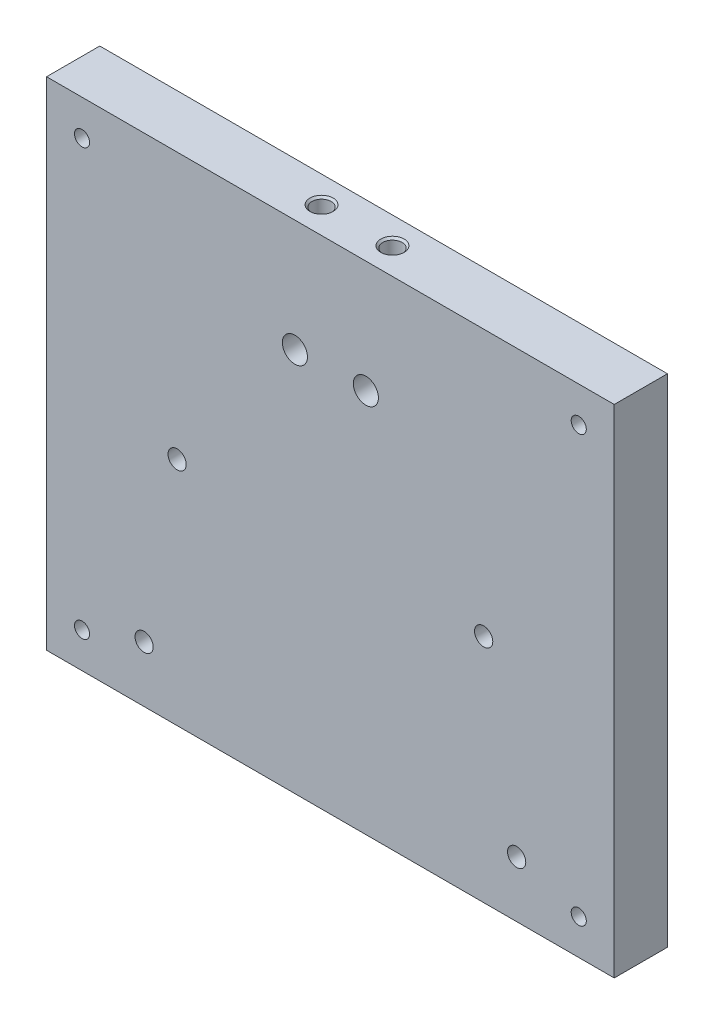
ISO-10303-21;
HEADER;
FILE_DESCRIPTION(('STEP AP214'),'2;1');
FILE_NAME('part.step','',(''),(''),'','','');
FILE_SCHEMA(('AUTOMOTIVE_DESIGN { 1 0 10303 214 1 1 1 1 }'));
ENDSEC;
DATA;
#1=APPLICATION_CONTEXT('core data for automotive mechanical design processes');
#2=APPLICATION_PROTOCOL_DEFINITION('international standard','automotive_design',2000,#1);
#3=PRODUCT_CONTEXT('',#1,'mechanical');
#4=PRODUCT('Part','Part','',(#3));
#5=PRODUCT_RELATED_PRODUCT_CATEGORY('part','',(#4));
#6=PRODUCT_DEFINITION_FORMATION('','',#4);
#7=PRODUCT_DEFINITION_CONTEXT('part definition',#1,'design');
#8=PRODUCT_DEFINITION('design','',#6,#7);
#9=PRODUCT_DEFINITION_SHAPE('','',#8);
#10=(LENGTH_UNIT() NAMED_UNIT(*) SI_UNIT(.MILLI.,.METRE.));
#11=(NAMED_UNIT(*) PLANE_ANGLE_UNIT() SI_UNIT($,.RADIAN.));
#12=(NAMED_UNIT(*) SI_UNIT($,.STERADIAN.) SOLID_ANGLE_UNIT());
#13=UNCERTAINTY_MEASURE_WITH_UNIT(LENGTH_MEASURE(1.E-05),#10,'distance_accuracy_value','');
#14=(GEOMETRIC_REPRESENTATION_CONTEXT(3) GLOBAL_UNCERTAINTY_ASSIGNED_CONTEXT((#13)) GLOBAL_UNIT_ASSIGNED_CONTEXT((#10,
#11,#12)) REPRESENTATION_CONTEXT('',''));
#15=CARTESIAN_POINT('',(0.,0.,0.));
#16=DIRECTION('',(0.,0.,1.));
#17=DIRECTION('',(1.,0.,0.));
#18=AXIS2_PLACEMENT_3D('',#15,#16,#17);
#19=CARTESIAN_POINT('',(0.,0.,0.));
#20=DIRECTION('',(0.,0.,1.));
#21=DIRECTION('',(1.,0.,0.));
#22=AXIS2_PLACEMENT_3D('',#19,#20,#21);
#23=PLANE('',#22);
#24=CARTESIAN_POINT('',(-23.368,41.275,0.));
#25=DIRECTION('',(0.,0.,-1.));
#26=DIRECTION('',(-1.,0.,0.));
#27=AXIS2_PLACEMENT_3D('',#24,#25,#26);
#28=CIRCLE('',#27,1.63194999999999);
#29=CARTESIAN_POINT('',(-24.99995,41.275,0.));
#30=VERTEX_POINT('',#29);
#31=EDGE_CURVE('E240',#30,#30,#28,.T.);
#32=ORIENTED_EDGE('',*,*,#31,.F.);
#33=EDGE_LOOP('',(#32));
#34=FACE_BOUND('',#33,.T.);
#35=CARTESIAN_POINT('',(-17.4625,10.033,0.));
#36=DIRECTION('',(0.,0.,1.));
#37=DIRECTION('',(1.,0.,0.));
#38=AXIS2_PLACEMENT_3D('',#35,#36,#37);
#39=CIRCLE('',#38,1.63195);
#40=CARTESIAN_POINT('',(-15.83055,10.033,0.));
#41=VERTEX_POINT('',#40);
#42=EDGE_CURVE('E225',#41,#41,#39,.T.);
#43=ORIENTED_EDGE('',*,*,#42,.T.);
#44=EDGE_LOOP('',(#43));
#45=FACE_BOUND('',#44,.T.);
#46=CARTESIAN_POINT('',(-84.1375,10.033,0.));
#47=DIRECTION('',(0.,0.,1.));
#48=DIRECTION('',(1.,0.,0.));
#49=AXIS2_PLACEMENT_3D('',#46,#47,#48);
#50=CIRCLE('',#49,1.63194999999999);
#51=CARTESIAN_POINT('',(-82.50555,10.033,0.));
#52=VERTEX_POINT('',#51);
#53=EDGE_CURVE('E219',#52,#52,#50,.T.);
#54=ORIENTED_EDGE('',*,*,#53,.T.);
#55=EDGE_LOOP('',(#54));
#56=FACE_BOUND('',#55,.T.);
#57=CARTESIAN_POINT('',(-95.25,6.34999999999999,0.));
#58=DIRECTION('',(0.,0.,1.));
#59=DIRECTION('',(1.,0.,0.));
#60=AXIS2_PLACEMENT_3D('',#57,#58,#59);
#61=CIRCLE('',#60,1.35254999999999);
#62=CARTESIAN_POINT('',(-93.89745,6.34999999999999,0.));
#63=VERTEX_POINT('',#62);
#64=EDGE_CURVE('E213',#63,#63,#61,.T.);
#65=ORIENTED_EDGE('',*,*,#64,.T.);
#66=EDGE_LOOP('',(#65));
#67=FACE_BOUND('',#66,.T.);
#68=CARTESIAN_POINT('',(-95.25,82.55,0.));
#69=DIRECTION('',(0.,0.,1.));
#70=DIRECTION('',(1.,0.,0.));
#71=AXIS2_PLACEMENT_3D('',#68,#69,#70);
#72=CIRCLE('',#71,1.35254999999999);
#73=CARTESIAN_POINT('',(-93.89745,82.55,0.));
#74=VERTEX_POINT('',#73);
#75=EDGE_CURVE('E207',#74,#74,#72,.T.);
#76=ORIENTED_EDGE('',*,*,#75,.T.);
#77=EDGE_LOOP('',(#76));
#78=FACE_BOUND('',#77,.T.);
#79=CARTESIAN_POINT('',(-6.35,6.35,0.));
#80=DIRECTION('',(0.,0.,1.));
#81=DIRECTION('',(1.,0.,0.));
#82=AXIS2_PLACEMENT_3D('',#79,#80,#81);
#83=CIRCLE('',#82,1.35255);
#84=CARTESIAN_POINT('',(-4.99745,6.35,0.));
#85=VERTEX_POINT('',#84);
#86=EDGE_CURVE('E201',#85,#85,#83,.T.);
#87=ORIENTED_EDGE('',*,*,#86,.T.);
#88=EDGE_LOOP('',(#87));
#89=FACE_BOUND('',#88,.T.);
#90=CARTESIAN_POINT('',(-6.35,82.55,0.));
#91=DIRECTION('',(0.,0.,1.));
#92=DIRECTION('',(1.,0.,0.));
#93=AXIS2_PLACEMENT_3D('',#90,#91,#92);
#94=CIRCLE('',#93,1.35255);
#95=CARTESIAN_POINT('',(-4.99745,82.55,0.));
#96=VERTEX_POINT('',#95);
#97=EDGE_CURVE('E195',#96,#96,#94,.T.);
#98=ORIENTED_EDGE('',*,*,#97,.T.);
#99=EDGE_LOOP('',(#98));
#100=FACE_BOUND('',#99,.T.);
#101=CARTESIAN_POINT('',(-44.45,68.8121935388156,0.));
#102=DIRECTION('',(0.,0.,1.));
#103=DIRECTION('',(1.,0.,0.));
#104=AXIS2_PLACEMENT_3D('',#101,#102,#103);
#105=CIRCLE('',#104,2.2479);
#106=CARTESIAN_POINT('',(-42.2021,68.8121935388156,0.));
#107=VERTEX_POINT('',#106);
#108=EDGE_CURVE('E189',#107,#107,#105,.T.);
#109=ORIENTED_EDGE('',*,*,#108,.T.);
#110=EDGE_LOOP('',(#109));
#111=FACE_BOUND('',#110,.T.);
#112=CARTESIAN_POINT('',(-57.15,68.8121935388156,0.));
#113=DIRECTION('',(0.,0.,1.));
#114=DIRECTION('',(1.,0.,0.));
#115=AXIS2_PLACEMENT_3D('',#112,#113,#114);
#116=CIRCLE('',#115,2.2479);
#117=CARTESIAN_POINT('',(-54.9021,68.8121935388156,0.));
#118=VERTEX_POINT('',#117);
#119=EDGE_CURVE('E122',#118,#118,#116,.T.);
#120=ORIENTED_EDGE('',*,*,#119,.T.);
#121=EDGE_LOOP('',(#120));
#122=FACE_BOUND('',#121,.T.);
#123=DIRECTION('',(0.,1.,0.));
#124=VECTOR('',#123,1.);
#125=CARTESIAN_POINT('',(0.,0.,0.));
#126=LINE('',#125,#124);
#127=CARTESIAN_POINT('',(0.,0.,0.));
#128=VERTEX_POINT('',#127);
#129=CARTESIAN_POINT('',(0.,88.9,0.));
#130=VERTEX_POINT('',#129);
#131=EDGE_CURVE('E108',#128,#130,#126,.T.);
#132=ORIENTED_EDGE('',*,*,#131,.F.);
#133=DIRECTION('',(1.,0.,0.));
#134=VECTOR('',#133,1.);
#135=CARTESIAN_POINT('',(0.,0.,0.));
#136=LINE('',#135,#134);
#137=CARTESIAN_POINT('',(-101.6,0.,0.));
#138=VERTEX_POINT('',#137);
#139=EDGE_CURVE('E83',#138,#128,#136,.T.);
#140=ORIENTED_EDGE('',*,*,#139,.F.);
#141=DIRECTION('',(0.,-1.,0.));
#142=VECTOR('',#141,1.);
#143=CARTESIAN_POINT('',(-101.6,0.,0.));
#144=LINE('',#143,#142);
#145=CARTESIAN_POINT('',(-101.6,88.9,0.));
#146=VERTEX_POINT('',#145);
#147=EDGE_CURVE('E77',#146,#138,#144,.T.);
#148=ORIENTED_EDGE('',*,*,#147,.F.);
#149=DIRECTION('',(-1.,0.,0.));
#150=VECTOR('',#149,1.);
#151=CARTESIAN_POINT('',(0.,88.9,0.));
#152=LINE('',#151,#150);
#153=EDGE_CURVE('E99',#130,#146,#152,.T.);
#154=ORIENTED_EDGE('',*,*,#153,.F.);
#155=EDGE_LOOP('',(#132,#140,#148,#154));
#156=FACE_BOUND('',#155,.T.);
#157=CARTESIAN_POINT('',(-78.232,41.275,0.));
#158=DIRECTION('',(0.,0.,-1.));
#159=DIRECTION('',(-1.,0.,0.));
#160=AXIS2_PLACEMENT_3D('',#157,#158,#159);
#161=CIRCLE('',#160,1.63194999999999);
#162=CARTESIAN_POINT('',(-79.86395,41.275,0.));
#163=VERTEX_POINT('',#162);
#164=EDGE_CURVE('E234',#163,#163,#161,.T.);
#165=ORIENTED_EDGE('',*,*,#164,.F.);
#166=EDGE_LOOP('',(#165));
#167=FACE_BOUND('',#166,.T.);
#168=ADVANCED_FACE('F37',(#34,#45,#56,#67,#78,#89,#100,#111,#122,#156,#167),#23,.F.);
#169=CARTESIAN_POINT('',(0.,0.,9.525));
#170=DIRECTION('',(-1.,0.,0.));
#171=DIRECTION('',(0.,0.,1.));
#172=AXIS2_PLACEMENT_3D('',#169,#170,#171);
#173=PLANE('',#172);
#174=ORIENTED_EDGE('',*,*,#131,.T.);
#175=DIRECTION('',(0.,0.,-1.));
#176=VECTOR('',#175,1.);
#177=CARTESIAN_POINT('',(0.,88.9,9.525));
#178=LINE('',#177,#176);
#179=CARTESIAN_POINT('',(0.,88.9,9.525));
#180=VERTEX_POINT('',#179);
#181=EDGE_CURVE('E11',#180,#130,#178,.T.);
#182=ORIENTED_EDGE('',*,*,#181,.F.);
#183=DIRECTION('',(0.,1.,0.));
#184=VECTOR('',#183,1.);
#185=CARTESIAN_POINT('',(0.,0.,9.525));
#186=LINE('',#185,#184);
#187=CARTESIAN_POINT('',(0.,0.,9.525));
#188=VERTEX_POINT('',#187);
#189=EDGE_CURVE('E95',#188,#180,#186,.T.);
#190=ORIENTED_EDGE('',*,*,#189,.F.);
#191=DIRECTION('',(0.,0.,-1.));
#192=VECTOR('',#191,1.);
#193=CARTESIAN_POINT('',(0.,0.,9.525));
#194=LINE('',#193,#192);
#195=EDGE_CURVE('E104',#188,#128,#194,.T.);
#196=ORIENTED_EDGE('',*,*,#195,.T.);
#197=EDGE_LOOP('',(#174,#182,#190,#196));
#198=FACE_BOUND('',#197,.T.);
#199=ADVANCED_FACE('F39',(#198),#173,.F.);
#200=CARTESIAN_POINT('',(0.,88.9,9.525));
#201=DIRECTION('',(0.,-1.,0.));
#202=DIRECTION('',(0.,0.,-1.));
#203=AXIS2_PLACEMENT_3D('',#200,#201,#202);
#204=PLANE('',#203);
#205=CARTESIAN_POINT('',(-44.45,88.9,4.7625));
#206=DIRECTION('',(0.,1.,0.));
#207=DIRECTION('',(0.,0.,1.));
#208=AXIS2_PLACEMENT_3D('',#205,#206,#207);
#209=CIRCLE('',#208,2.0828);
#210=CARTESIAN_POINT('',(-44.45,88.9,6.8453));
#211=VERTEX_POINT('',#210);
#212=EDGE_CURVE('E173',#211,#211,#209,.T.);
#213=ORIENTED_EDGE('',*,*,#212,.F.);
#214=EDGE_LOOP('',(#213));
#215=FACE_BOUND('',#214,.T.);
#216=CARTESIAN_POINT('',(-57.15,88.9,4.7625));
#217=DIRECTION('',(0.,1.,0.));
#218=DIRECTION('',(0.,0.,1.));
#219=AXIS2_PLACEMENT_3D('',#216,#217,#218);
#220=CIRCLE('',#219,2.0828);
#221=CARTESIAN_POINT('',(-57.15,88.9,6.8453));
#222=VERTEX_POINT('',#221);
#223=EDGE_CURVE('E176',#222,#222,#220,.T.);
#224=ORIENTED_EDGE('',*,*,#223,.F.);
#225=EDGE_LOOP('',(#224));
#226=FACE_BOUND('',#225,.T.);
#227=ORIENTED_EDGE('',*,*,#153,.T.);
#228=DIRECTION('',(0.,0.,-1.));
#229=VECTOR('',#228,1.);
#230=CARTESIAN_POINT('',(-101.6,88.9,9.525));
#231=LINE('',#230,#229);
#232=CARTESIAN_POINT('',(-101.6,88.9,9.525));
#233=VERTEX_POINT('',#232);
#234=EDGE_CURVE('E51',#233,#146,#231,.T.);
#235=ORIENTED_EDGE('',*,*,#234,.F.);
#236=DIRECTION('',(-1.,0.,0.));
#237=VECTOR('',#236,1.);
#238=CARTESIAN_POINT('',(0.,88.9,9.525));
#239=LINE('',#238,#237);
#240=EDGE_CURVE('E90',#180,#233,#239,.T.);
#241=ORIENTED_EDGE('',*,*,#240,.F.);
#242=ORIENTED_EDGE('',*,*,#181,.T.);
#243=EDGE_LOOP('',(#227,#235,#241,#242));
#244=FACE_BOUND('',#243,.T.);
#245=ADVANCED_FACE('F98',(#215,#226,#244),#204,.F.);
#246=CARTESIAN_POINT('',(-101.6,0.,9.525));
#247=DIRECTION('',(1.,0.,0.));
#248=DIRECTION('',(0.,0.,-1.));
#249=AXIS2_PLACEMENT_3D('',#246,#247,#248);
#250=PLANE('',#249);
#251=ORIENTED_EDGE('',*,*,#147,.T.);
#252=DIRECTION('',(0.,0.,-1.));
#253=VECTOR('',#252,1.);
#254=CARTESIAN_POINT('',(-101.6,0.,9.525));
#255=LINE('',#254,#253);
#256=CARTESIAN_POINT('',(-101.6,0.,9.525));
#257=VERTEX_POINT('',#256);
#258=EDGE_CURVE('E100',#257,#138,#255,.T.);
#259=ORIENTED_EDGE('',*,*,#258,.F.);
#260=DIRECTION('',(0.,-1.,0.));
#261=VECTOR('',#260,1.);
#262=CARTESIAN_POINT('',(-101.6,0.,9.525));
#263=LINE('',#262,#261);
#264=EDGE_CURVE('E93',#233,#257,#263,.T.);
#265=ORIENTED_EDGE('',*,*,#264,.F.);
#266=ORIENTED_EDGE('',*,*,#234,.T.);
#267=EDGE_LOOP('',(#251,#259,#265,#266));
#268=FACE_BOUND('',#267,.T.);
#269=ADVANCED_FACE('F102',(#268),#250,.F.);
#270=CARTESIAN_POINT('',(0.,0.,9.525));
#271=DIRECTION('',(0.,1.,0.));
#272=DIRECTION('',(-1.,0.,0.));
#273=AXIS2_PLACEMENT_3D('',#270,#271,#272);
#274=PLANE('',#273);
#275=ORIENTED_EDGE('',*,*,#139,.T.);
#276=ORIENTED_EDGE('',*,*,#195,.F.);
#277=DIRECTION('',(1.,0.,0.));
#278=VECTOR('',#277,1.);
#279=CARTESIAN_POINT('',(0.,0.,9.525));
#280=LINE('',#279,#278);
#281=EDGE_CURVE('E60',#257,#188,#280,.T.);
#282=ORIENTED_EDGE('',*,*,#281,.F.);
#283=ORIENTED_EDGE('',*,*,#258,.T.);
#284=EDGE_LOOP('',(#275,#276,#282,#283));
#285=FACE_BOUND('',#284,.T.);
#286=ADVANCED_FACE('F162',(#285),#274,.F.);
#287=CARTESIAN_POINT('',(0.,0.,9.525));
#288=DIRECTION('',(0.,0.,1.));
#289=DIRECTION('',(1.,0.,0.));
#290=AXIS2_PLACEMENT_3D('',#287,#288,#289);
#291=PLANE('',#290);
#292=CARTESIAN_POINT('',(-23.368,41.275,9.525));
#293=DIRECTION('',(0.,0.,1.));
#294=DIRECTION('',(1.,0.,0.));
#295=AXIS2_PLACEMENT_3D('',#292,#293,#294);
#296=CIRCLE('',#295,1.63194999999999);
#297=CARTESIAN_POINT('',(-21.73605,41.275,9.525));
#298=VERTEX_POINT('',#297);
#299=EDGE_CURVE('E237',#298,#298,#296,.T.);
#300=ORIENTED_EDGE('',*,*,#299,.F.);
#301=EDGE_LOOP('',(#300));
#302=FACE_BOUND('',#301,.T.);
#303=CARTESIAN_POINT('',(-78.232,41.275,9.525));
#304=DIRECTION('',(0.,0.,1.));
#305=DIRECTION('',(1.,0.,0.));
#306=AXIS2_PLACEMENT_3D('',#303,#304,#305);
#307=CIRCLE('',#306,1.63194999999999);
#308=CARTESIAN_POINT('',(-76.60005,41.275,9.525));
#309=VERTEX_POINT('',#308);
#310=EDGE_CURVE('E231',#309,#309,#307,.T.);
#311=ORIENTED_EDGE('',*,*,#310,.F.);
#312=EDGE_LOOP('',(#311));
#313=FACE_BOUND('',#312,.T.);
#314=CARTESIAN_POINT('',(-17.4625,10.033,9.525));
#315=DIRECTION('',(0.,0.,1.));
#316=DIRECTION('',(1.,0.,0.));
#317=AXIS2_PLACEMENT_3D('',#314,#315,#316);
#318=CIRCLE('',#317,1.63195);
#319=CARTESIAN_POINT('',(-15.83055,10.033,9.525));
#320=VERTEX_POINT('',#319);
#321=EDGE_CURVE('E228',#320,#320,#318,.T.);
#322=ORIENTED_EDGE('',*,*,#321,.F.);
#323=EDGE_LOOP('',(#322));
#324=FACE_BOUND('',#323,.T.);
#325=CARTESIAN_POINT('',(-84.1375,10.033,9.525));
#326=DIRECTION('',(0.,0.,1.));
#327=DIRECTION('',(1.,0.,0.));
#328=AXIS2_PLACEMENT_3D('',#325,#326,#327);
#329=CIRCLE('',#328,1.63194999999999);
#330=CARTESIAN_POINT('',(-82.50555,10.033,9.525));
#331=VERTEX_POINT('',#330);
#332=EDGE_CURVE('E222',#331,#331,#329,.T.);
#333=ORIENTED_EDGE('',*,*,#332,.F.);
#334=EDGE_LOOP('',(#333));
#335=FACE_BOUND('',#334,.T.);
#336=CARTESIAN_POINT('',(-95.25,6.34999999999999,9.525));
#337=DIRECTION('',(0.,0.,1.));
#338=DIRECTION('',(1.,0.,0.));
#339=AXIS2_PLACEMENT_3D('',#336,#337,#338);
#340=CIRCLE('',#339,1.35254999999998);
#341=CARTESIAN_POINT('',(-93.89745,6.34999999999999,9.525));
#342=VERTEX_POINT('',#341);
#343=EDGE_CURVE('E216',#342,#342,#340,.T.);
#344=ORIENTED_EDGE('',*,*,#343,.F.);
#345=EDGE_LOOP('',(#344));
#346=FACE_BOUND('',#345,.T.);
#347=CARTESIAN_POINT('',(-95.25,82.55,9.525));
#348=DIRECTION('',(0.,0.,1.));
#349=DIRECTION('',(1.,0.,0.));
#350=AXIS2_PLACEMENT_3D('',#347,#348,#349);
#351=CIRCLE('',#350,1.35254999999998);
#352=CARTESIAN_POINT('',(-93.89745,82.55,9.525));
#353=VERTEX_POINT('',#352);
#354=EDGE_CURVE('E210',#353,#353,#351,.T.);
#355=ORIENTED_EDGE('',*,*,#354,.F.);
#356=EDGE_LOOP('',(#355));
#357=FACE_BOUND('',#356,.T.);
#358=CARTESIAN_POINT('',(-6.35,6.35,9.525));
#359=DIRECTION('',(0.,0.,1.));
#360=DIRECTION('',(1.,0.,0.));
#361=AXIS2_PLACEMENT_3D('',#358,#359,#360);
#362=CIRCLE('',#361,1.35254999999999);
#363=CARTESIAN_POINT('',(-4.99745000000001,6.35,9.525));
#364=VERTEX_POINT('',#363);
#365=EDGE_CURVE('E204',#364,#364,#362,.T.);
#366=ORIENTED_EDGE('',*,*,#365,.F.);
#367=EDGE_LOOP('',(#366));
#368=FACE_BOUND('',#367,.T.);
#369=CARTESIAN_POINT('',(-6.35,82.55,9.525));
#370=DIRECTION('',(0.,0.,1.));
#371=DIRECTION('',(1.,0.,0.));
#372=AXIS2_PLACEMENT_3D('',#369,#370,#371);
#373=CIRCLE('',#372,1.35254999999999);
#374=CARTESIAN_POINT('',(-4.99745000000001,82.55,9.525));
#375=VERTEX_POINT('',#374);
#376=EDGE_CURVE('E198',#375,#375,#373,.T.);
#377=ORIENTED_EDGE('',*,*,#376,.F.);
#378=EDGE_LOOP('',(#377));
#379=FACE_BOUND('',#378,.T.);
#380=CARTESIAN_POINT('',(-44.45,68.8121935388156,9.525));
#381=DIRECTION('',(0.,0.,1.));
#382=DIRECTION('',(1.,0.,0.));
#383=AXIS2_PLACEMENT_3D('',#380,#381,#382);
#384=CIRCLE('',#383,2.2479);
#385=CARTESIAN_POINT('',(-42.2021,68.8121935388156,9.525));
#386=VERTEX_POINT('',#385);
#387=EDGE_CURVE('E192',#386,#386,#384,.T.);
#388=ORIENTED_EDGE('',*,*,#387,.F.);
#389=EDGE_LOOP('',(#388));
#390=FACE_BOUND('',#389,.T.);
#391=CARTESIAN_POINT('',(-57.15,68.8121935388156,9.525));
#392=DIRECTION('',(0.,0.,1.));
#393=DIRECTION('',(1.,0.,0.));
#394=AXIS2_PLACEMENT_3D('',#391,#392,#393);
#395=CIRCLE('',#394,2.2479);
#396=CARTESIAN_POINT('',(-54.9021,68.8121935388156,9.525));
#397=VERTEX_POINT('',#396);
#398=EDGE_CURVE('E123',#397,#397,#395,.T.);
#399=ORIENTED_EDGE('',*,*,#398,.F.);
#400=EDGE_LOOP('',(#399));
#401=FACE_BOUND('',#400,.T.);
#402=ORIENTED_EDGE('',*,*,#189,.T.);
#403=ORIENTED_EDGE('',*,*,#240,.T.);
#404=ORIENTED_EDGE('',*,*,#264,.T.);
#405=ORIENTED_EDGE('',*,*,#281,.T.);
#406=EDGE_LOOP('',(#402,#403,#404,#405));
#407=FACE_BOUND('',#406,.T.);
#408=ADVANCED_FACE('F91',(#302,#313,#324,#335,#346,#357,#368,#379,#390,#401,#407),#291,.T.);
#409=CARTESIAN_POINT('',(-57.15,88.9,4.7625));
#410=DIRECTION('',(0.,1.,0.));
#411=DIRECTION('',(0.,0.,1.));
#412=AXIS2_PLACEMENT_3D('',#409,#410,#411);
#413=CYLINDRICAL_SURFACE('',#412,1.72719999999999);
#414=CARTESIAN_POINT('',(-57.15,71.0600935388156,6.48969999999999));
#415=CARTESIAN_POINT('',(-57.2338587410568,71.060086904255,6.48969312604296));
#416=CARTESIAN_POINT('',(-57.3178007097025,71.0553545921181,6.48354623436465));
#417=CARTESIAN_POINT('',(-57.482983545752,71.0368544226834,6.45936168885247));
#418=CARTESIAN_POINT('',(-57.564219807188,71.0230719102294,6.4413047486447));
#419=CARTESIAN_POINT('',(-57.7212109052852,70.9877880246278,6.39455705136511));
#420=CARTESIAN_POINT('',(-57.7969948117855,70.9663319025046,6.36592860262387));
#421=CARTESIAN_POINT('',(-57.9421572992914,70.9172873642362,6.29940904803435));
#422=CARTESIAN_POINT('',(-58.0115362630018,70.8896993148187,6.26151849610452));
#423=CARTESIAN_POINT('',(-58.1493250995929,70.8272979612141,6.17383002268562));
#424=CARTESIAN_POINT('',(-58.2170357260977,70.7920499657781,6.12324928318421));
#425=CARTESIAN_POINT('',(-58.3435539193056,70.7184601313201,6.01376408652045));
#426=CARTESIAN_POINT('',(-58.4023483646323,70.6801138574619,5.95484760379497));
#427=CARTESIAN_POINT('',(-58.522282918305,70.5944409174577,5.81615065068791));
#428=CARTESIAN_POINT('',(-58.5812575240503,70.5469404095441,5.73459870126199));
#429=CARTESIAN_POINT('',(-58.6849513562198,70.4558815988741,5.56084877572077));
#430=CARTESIAN_POINT('',(-58.7296874065091,70.4123186874931,5.46866354045662));
#431=CARTESIAN_POINT('',(-58.7900606235057,70.3498654563105,5.30832591115649));
#432=CARTESIAN_POINT('',(-58.8103917039639,70.3277024329169,5.24323328028774));
#433=CARTESIAN_POINT('',(-58.8434460374248,70.2906769691249,5.10920362861217));
#434=CARTESIAN_POINT('',(-58.8561871439236,70.2757974110462,5.04027604988117));
#435=CARTESIAN_POINT('',(-58.8732615259641,70.2556672049597,4.89916501610035));
#436=CARTESIAN_POINT('',(-58.877505063932,70.2505193590108,4.82695496306086));
#437=CARTESIAN_POINT('',(-58.876860526688,70.2512929576657,4.68262666503325));
#438=CARTESIAN_POINT('',(-58.8719716244093,70.2572154048352,4.6105084289523));
#439=CARTESIAN_POINT('',(-58.8547260577636,70.277492682559,4.47780459497311));
#440=CARTESIAN_POINT('',(-58.8433719539128,70.2907092527734,4.41689885622891));
#441=CARTESIAN_POINT('',(-58.8147154393665,70.3229029254255,4.2980835964108));
#442=CARTESIAN_POINT('',(-58.7974065878164,70.3418862627797,4.24017739809543));
#443=CARTESIAN_POINT('',(-58.7443913991846,70.3975131251712,4.09102316987052));
#444=CARTESIAN_POINT('',(-58.7040534442491,70.4375919011801,4.00270760117156));
#445=CARTESIAN_POINT('',(-58.6104866123807,70.5221761162231,3.83545283073586));
#446=CARTESIAN_POINT('',(-58.5572249998136,70.5666926245992,3.75653821068905));
#447=CARTESIAN_POINT('',(-58.436588888252,70.6570819785915,3.60599680895957));
#448=CARTESIAN_POINT('',(-58.368814115099,70.7029521909512,3.53468774975974));
#449=CARTESIAN_POINT('',(-58.2207196149448,70.7905760055162,3.40363199358155));
#450=CARTESIAN_POINT('',(-58.1404227111641,70.8323368760178,3.34386469531416));
#451=CARTESIAN_POINT('',(-57.9837738505528,70.9011643912926,3.24761678211483));
#452=CARTESIAN_POINT('',(-57.9093850147246,70.9295216417677,3.2088764756708));
#453=CARTESIAN_POINT('',(-57.7537035464139,70.9790464814958,3.1420301183691));
#454=CARTESIAN_POINT('',(-57.672414838484,71.0002181240198,3.11391807128019));
#455=CARTESIAN_POINT('',(-57.5041740263861,71.0336825126222,3.06975411346075));
#456=CARTESIAN_POINT('',(-57.4171861503527,71.045911843363,3.05378830745377));
#457=CARTESIAN_POINT('',(-57.2409694820482,71.0599863863113,3.03542882362511));
#458=CARTESIAN_POINT('',(-57.1517421166426,71.0618380498904,3.03302671380071));
#459=CARTESIAN_POINT('',(-56.9846886385171,71.0553836480959,3.04143338103207));
#460=CARTESIAN_POINT('',(-56.9067353185669,71.0482253820798,3.05074927760056));
#461=CARTESIAN_POINT('',(-56.7538588527044,71.0262603266978,3.0795431434207));
#462=CARTESIAN_POINT('',(-56.6789362245479,71.0114522363556,3.0990228411967));
#463=CARTESIAN_POINT('',(-56.5325065585192,70.9749599305833,3.14757439599707));
#464=CARTESIAN_POINT('',(-56.4610853070559,70.9531567107109,3.17681264533635));
#465=CARTESIAN_POINT('',(-56.3242519629292,70.904197937889,3.2435656100777));
#466=CARTESIAN_POINT('',(-56.2588408629212,70.877041503107,3.28108168920412));
#467=CARTESIAN_POINT('',(-56.124585956842,70.8141731411896,3.36993637006008));
#468=CARTESIAN_POINT('',(-56.056890699999,70.7777877654858,3.42252850178318));
#469=CARTESIAN_POINT('',(-55.9307257199699,70.7021277922577,3.53619762696586));
#470=CARTESIAN_POINT('',(-55.8722732112681,70.6628479987523,3.59729006354028));
#471=CARTESIAN_POINT('',(-55.7538717457043,70.5758023187386,3.74054577584216));
#472=CARTESIAN_POINT('',(-55.6960902118931,70.5279535396926,3.82445799456168));
#473=CARTESIAN_POINT('',(-55.5952965394909,70.4371616109442,4.00315408040514));
#474=CARTESIAN_POINT('',(-55.5522577439943,70.3942097018897,4.09791790774284));
#475=CARTESIAN_POINT('',(-55.4960855545295,70.334896692577,4.26037216706616));
#476=CARTESIAN_POINT('',(-55.4777934504767,70.3146122858316,4.32482580212367));
#477=CARTESIAN_POINT('',(-55.4486549094326,70.2815363831526,4.45718781227));
#478=CARTESIAN_POINT('',(-55.437790339149,70.268726650132,4.52508733574435));
#479=CARTESIAN_POINT('',(-55.4242295328618,70.2526434317699,4.66350200606324));
#480=CARTESIAN_POINT('',(-55.4216066863791,70.2494556360684,4.73403502512876));
#481=CARTESIAN_POINT('',(-55.4250060378156,70.2535307464002,4.87460523288237));
#482=CARTESIAN_POINT('',(-55.4310337168646,70.2608002783929,4.94464207892255));
#483=CARTESIAN_POINT('',(-55.4523003610492,70.2856771345953,5.0896087014841));
#484=CARTESIAN_POINT('',(-55.4684978596905,70.3043538508374,5.16420452961273));
#485=CARTESIAN_POINT('',(-55.5096478847756,70.3494724340902,5.3085105132186));
#486=CARTESIAN_POINT('',(-55.534623659396,70.3759348900524,5.3782070996473));
#487=CARTESIAN_POINT('',(-55.6044511043617,70.4454898069933,5.54048662174002));
#488=CARTESIAN_POINT('',(-55.6532443092734,70.4908958038255,5.63036770098031));
#489=CARTESIAN_POINT('',(-55.764968416866,70.584218708349,5.79941089060644));
#490=CARTESIAN_POINT('',(-55.8279180031055,70.6321388695563,5.87855861179797));
#491=CARTESIAN_POINT('',(-55.9689246554768,70.7267394144311,6.0270058201192));
#492=CARTESIAN_POINT('',(-56.0472743747089,70.7733718020639,6.09606024449322));
#493=CARTESIAN_POINT('',(-56.2175828887103,70.8598070961633,6.22018922962522));
#494=CARTESIAN_POINT('',(-56.3095116740699,70.8996246546895,6.27529390818552));
#495=CARTESIAN_POINT('',(-56.4793467049826,70.9590761469812,6.35617532596232));
#496=CARTESIAN_POINT('',(-56.5545075552948,70.9812624020037,6.3858542615825));
#497=CARTESIAN_POINT('',(-56.7098827532914,71.0180224318158,6.43465663578117));
#498=CARTESIAN_POINT('',(-56.7900856065726,71.0326128647271,6.45380317784225));
#499=CARTESIAN_POINT('',(-56.9174756623903,71.0485131486866,6.47460723441107));
#500=CARTESIAN_POINT('',(-56.9636789570766,71.0528415514883,6.48025286575565));
#501=CARTESIAN_POINT('',(-57.0565794813871,71.0586339250205,6.48780159493144));
#502=CARTESIAN_POINT('',(-57.103276822393,71.0600972353623,6.48970382993008));
#503=CARTESIAN_POINT('',(-57.15,71.0600935388156,6.48969999999999));
#504=B_SPLINE_CURVE_WITH_KNOTS('',3,(#414,#415,#416,#417,#418,#419,#420,#421,#422,#423,#424,
#425,#426,#427,#428,#429,#430,#431,#432,#433,#434,#435,#436,#437,#438,#439,#440,#441,#442,#443,
#444,#445,#446,#447,#448,#449,#450,#451,#452,#453,#454,#455,#456,#457,#458,#459,#460,#461,#462,
#463,#464,#465,#466,#467,#468,#469,#470,#471,#472,#473,#474,#475,#476,#477,#478,#479,#480,#481,
#482,#483,#484,#485,#486,#487,#488,#489,#490,#491,#492,#493,#494,#495,#496,#497,#498,#499,#500,
#501,#502,#503),.UNSPECIFIED.,.T.,.F.,(4,2,2,2,2,2,2,2,2,2,2,2,2,2,2,2,2,2,2,2,2,2,2,2,2,2,2,2,
2,2,2,2,2,2,2,2,2,2,2,2,2,2,2,2,4),(0.,0.251377647963261,0.503163363560241,0.753488147133668,
1.00379796373903,1.27754956594076,1.5517002010665,1.88421693999148,2.2163393155103,
2.43076881398844,2.64469190889991,2.86086244504949,3.07705255933148,3.266400576332,
3.45595404577307,3.76934397398976,4.08353616146979,4.4078766163174,4.73163268232421,
4.99619252404819,5.26060288337363,5.52687061759844,5.79297280567576,6.02835979102066,
6.26378682091259,6.50345272550826,6.74315814318813,7.0215334572368,7.30042128487889,
7.63670071162247,7.97236884888695,8.18168109612676,8.39048049402957,8.60113398047308,
8.81192099972789,9.04638269788549,9.28147007670802,9.61542353060049,9.94982034944545,
10.2913243064109,10.632084536869,10.8824876559646,11.1323392868577,11.2723659088719,
11.4124248024852),.UNSPECIFIED.);
#505=CARTESIAN_POINT('',(-57.15,71.0600935388156,6.48969999999999));
#506=VERTEX_POINT('',#505);
#507=EDGE_CURVE('E116',#506,#506,#504,.T.);
#508=ORIENTED_EDGE('',*,*,#507,.T.);
#509=EDGE_LOOP('',(#508));
#510=FACE_BOUND('',#509,.T.);
#511=CARTESIAN_POINT('',(-57.15,88.5444,4.7625));
#512=DIRECTION('',(0.,1.,0.));
#513=DIRECTION('',(0.,0.,1.));
#514=AXIS2_PLACEMENT_3D('',#511,#512,#513);
#515=CIRCLE('',#514,1.7272);
#516=CARTESIAN_POINT('',(-57.15,88.5444,6.4897));
#517=VERTEX_POINT('',#516);
#518=EDGE_CURVE('E111',#517,#517,#515,.T.);
#519=ORIENTED_EDGE('',*,*,#518,.T.);
#520=EDGE_LOOP('',(#519));
#521=FACE_BOUND('',#520,.T.);
#522=ADVANCED_FACE('F124',(#510,#521),#413,.F.);
#523=CARTESIAN_POINT('',(-57.15,88.9,4.7625));
#524=DIRECTION('',(0.,1.,0.));
#525=DIRECTION('',(0.,0.,1.));
#526=AXIS2_PLACEMENT_3D('',#523,#524,#525);
#527=CONICAL_SURFACE('',#526,2.0828,0.785398163397439);
#528=ORIENTED_EDGE('',*,*,#518,.F.);
#529=EDGE_LOOP('',(#528));
#530=FACE_BOUND('',#529,.T.);
#531=ORIENTED_EDGE('',*,*,#223,.T.);
#532=EDGE_LOOP('',(#531));
#533=FACE_BOUND('',#532,.T.);
#534=ADVANCED_FACE('F142',(#530,#533),#527,.F.);
#535=CARTESIAN_POINT('',(-44.45,88.9,4.7625));
#536=DIRECTION('',(0.,1.,0.));
#537=DIRECTION('',(0.,0.,1.));
#538=AXIS2_PLACEMENT_3D('',#535,#536,#537);
#539=CYLINDRICAL_SURFACE('',#538,1.72719999999999);
#540=CARTESIAN_POINT('',(-44.45,71.0600935388156,6.48969999999999));
#541=CARTESIAN_POINT('',(-44.5338587410568,71.060086904255,6.48969312604296));
#542=CARTESIAN_POINT('',(-44.6178007097025,71.0553545921181,6.48354623436465));
#543=CARTESIAN_POINT('',(-44.782983545752,71.0368544226835,6.45936168885247));
#544=CARTESIAN_POINT('',(-44.864219807188,71.0230719102294,6.4413047486447));
#545=CARTESIAN_POINT('',(-45.0212109052852,70.9877880246278,6.39455705136511));
#546=CARTESIAN_POINT('',(-45.0969948117855,70.9663319025046,6.36592860262386));
#547=CARTESIAN_POINT('',(-45.2421572992914,70.9172873642362,6.29940904803435));
#548=CARTESIAN_POINT('',(-45.3115362630018,70.8896993148187,6.26151849610452));
#549=CARTESIAN_POINT('',(-45.4493250995929,70.8272979612142,6.17383002268562));
#550=CARTESIAN_POINT('',(-45.5170357260977,70.7920499657781,6.12324928318421));
#551=CARTESIAN_POINT('',(-45.6435539193056,70.7184601313201,6.01376408652045));
#552=CARTESIAN_POINT('',(-45.7023483646323,70.6801138574619,5.95484760379497));
#553=CARTESIAN_POINT('',(-45.822282918305,70.5944409174577,5.8161506506879));
#554=CARTESIAN_POINT('',(-45.8812575240503,70.5469404095441,5.73459870126199));
#555=CARTESIAN_POINT('',(-45.9849513562198,70.4558815988741,5.56084877572076));
#556=CARTESIAN_POINT('',(-46.0296874065091,70.4123186874931,5.46866354045662));
#557=CARTESIAN_POINT('',(-46.0900606235057,70.3498654563106,5.30832591115648));
#558=CARTESIAN_POINT('',(-46.1103917039639,70.3277024329169,5.24323328028774));
#559=CARTESIAN_POINT('',(-46.1434460374248,70.2906769691249,5.10920362861217));
#560=CARTESIAN_POINT('',(-46.1561871439236,70.2757974110462,5.04027604988117));
#561=CARTESIAN_POINT('',(-46.1732615259641,70.2556672049598,4.89916501610035));
#562=CARTESIAN_POINT('',(-46.177505063932,70.2505193590108,4.82695496306086));
#563=CARTESIAN_POINT('',(-46.176860526688,70.2512929576657,4.68262666503325));
#564=CARTESIAN_POINT('',(-46.1719716244093,70.2572154048353,4.6105084289523));
#565=CARTESIAN_POINT('',(-46.1547260577636,70.277492682559,4.4778045949731));
#566=CARTESIAN_POINT('',(-46.1433719539128,70.2907092527735,4.4168988562289));
#567=CARTESIAN_POINT('',(-46.1147154393664,70.3229029254256,4.2980835964108));
#568=CARTESIAN_POINT('',(-46.0974065878164,70.3418862627798,4.24017739809543));
#569=CARTESIAN_POINT('',(-46.0443913991846,70.3975131251712,4.09102316987052));
#570=CARTESIAN_POINT('',(-46.0040534442491,70.4375919011801,4.00270760117155));
#571=CARTESIAN_POINT('',(-45.9104866123807,70.5221761162232,3.83545283073585));
#572=CARTESIAN_POINT('',(-45.8572249998136,70.5666926245992,3.75653821068905));
#573=CARTESIAN_POINT('',(-45.736588888252,70.6570819785916,3.60599680895957));
#574=CARTESIAN_POINT('',(-45.668814115099,70.7029521909512,3.53468774975974));
#575=CARTESIAN_POINT('',(-45.5207196149448,70.7905760055162,3.40363199358155));
#576=CARTESIAN_POINT('',(-45.4404227111641,70.8323368760179,3.34386469531416));
#577=CARTESIAN_POINT('',(-45.2837738505528,70.9011643912926,3.24761678211483));
#578=CARTESIAN_POINT('',(-45.2093850147246,70.9295216417677,3.2088764756708));
#579=CARTESIAN_POINT('',(-45.0537035464139,70.9790464814959,3.1420301183691));
#580=CARTESIAN_POINT('',(-44.972414838484,71.0002181240199,3.11391807128019));
#581=CARTESIAN_POINT('',(-44.8041740263861,71.0336825126222,3.06975411346075));
#582=CARTESIAN_POINT('',(-44.7171861503527,71.045911843363,3.05378830745377));
#583=CARTESIAN_POINT('',(-44.5409694820481,71.0599863863113,3.0354288236251));
#584=CARTESIAN_POINT('',(-44.4517421166426,71.0618380498904,3.03302671380071));
#585=CARTESIAN_POINT('',(-44.2846886385171,71.0553836480959,3.04143338103207));
#586=CARTESIAN_POINT('',(-44.2067353185669,71.0482253820798,3.05074927760056));
#587=CARTESIAN_POINT('',(-44.0538588527044,71.0262603266979,3.0795431434207));
#588=CARTESIAN_POINT('',(-43.9789362245479,71.0114522363557,3.0990228411967));
#589=CARTESIAN_POINT('',(-43.8325065585192,70.9749599305834,3.14757439599706));
#590=CARTESIAN_POINT('',(-43.7610853070559,70.953156710711,3.17681264533635));
#591=CARTESIAN_POINT('',(-43.6242519629292,70.904197937889,3.2435656100777));
#592=CARTESIAN_POINT('',(-43.5588408629212,70.877041503107,3.28108168920411));
#593=CARTESIAN_POINT('',(-43.424585956842,70.8141731411896,3.36993637006008));
#594=CARTESIAN_POINT('',(-43.356890699999,70.7777877654858,3.42252850178318));
#595=CARTESIAN_POINT('',(-43.2307257199699,70.7021277922577,3.53619762696586));
#596=CARTESIAN_POINT('',(-43.1722732112681,70.6628479987523,3.59729006354028));
#597=CARTESIAN_POINT('',(-43.0538717457043,70.5758023187386,3.74054577584216));
#598=CARTESIAN_POINT('',(-42.9960902118931,70.5279535396927,3.82445799456167));
#599=CARTESIAN_POINT('',(-42.8952965394909,70.4371616109442,4.00315408040513));
#600=CARTESIAN_POINT('',(-42.8522577439943,70.3942097018897,4.09791790774283));
#601=CARTESIAN_POINT('',(-42.7960855545295,70.3348966925771,4.26037216706616));
#602=CARTESIAN_POINT('',(-42.7777934504767,70.3146122858316,4.32482580212367));
#603=CARTESIAN_POINT('',(-42.7486549094326,70.2815363831526,4.45718781227));
#604=CARTESIAN_POINT('',(-42.737790339149,70.268726650132,4.52508733574435));
#605=CARTESIAN_POINT('',(-42.7242295328618,70.25264343177,4.66350200606323));
#606=CARTESIAN_POINT('',(-42.7216066863791,70.2494556360684,4.73403502512876));
#607=CARTESIAN_POINT('',(-42.7250060378156,70.2535307464003,4.87460523288236));
#608=CARTESIAN_POINT('',(-42.7310337168646,70.2608002783929,4.94464207892254));
#609=CARTESIAN_POINT('',(-42.7523003610492,70.2856771345954,5.0896087014841));
#610=CARTESIAN_POINT('',(-42.7684978596905,70.3043538508375,5.16420452961272));
#611=CARTESIAN_POINT('',(-42.8096478847756,70.3494724340902,5.3085105132186));
#612=CARTESIAN_POINT('',(-42.834623659396,70.3759348900524,5.3782070996473));
#613=CARTESIAN_POINT('',(-42.9044511043617,70.4454898069933,5.54048662174002));
#614=CARTESIAN_POINT('',(-42.9532443092734,70.4908958038255,5.63036770098031));
#615=CARTESIAN_POINT('',(-43.064968416866,70.5842187083491,5.79941089060644));
#616=CARTESIAN_POINT('',(-43.1279180031055,70.6321388695564,5.87855861179797));
#617=CARTESIAN_POINT('',(-43.2689246554768,70.7267394144311,6.0270058201192));
#618=CARTESIAN_POINT('',(-43.3472743747089,70.773371802064,6.09606024449322));
#619=CARTESIAN_POINT('',(-43.5175828887103,70.8598070961633,6.22018922962522));
#620=CARTESIAN_POINT('',(-43.6095116740699,70.8996246546895,6.27529390818552));
#621=CARTESIAN_POINT('',(-43.7793467049826,70.9590761469812,6.35617532596232));
#622=CARTESIAN_POINT('',(-43.8545075552948,70.9812624020037,6.3858542615825));
#623=CARTESIAN_POINT('',(-44.0098827532914,71.0180224318158,6.43465663578117));
#624=CARTESIAN_POINT('',(-44.0900856065726,71.0326128647272,6.45380317784224));
#625=CARTESIAN_POINT('',(-44.2174756623902,71.0485131486866,6.47460723441106));
#626=CARTESIAN_POINT('',(-44.2636789570766,71.0528415514883,6.48025286575565));
#627=CARTESIAN_POINT('',(-44.3565794813871,71.0586339250205,6.48780159493144));
#628=CARTESIAN_POINT('',(-44.403276822393,71.0600972353623,6.48970382993008));
#629=CARTESIAN_POINT('',(-44.45,71.0600935388156,6.48969999999999));
#630=B_SPLINE_CURVE_WITH_KNOTS('',3,(#540,#541,#542,#543,#544,#545,#546,#547,#548,#549,#550,
#551,#552,#553,#554,#555,#556,#557,#558,#559,#560,#561,#562,#563,#564,#565,#566,#567,#568,#569,
#570,#571,#572,#573,#574,#575,#576,#577,#578,#579,#580,#581,#582,#583,#584,#585,#586,#587,#588,
#589,#590,#591,#592,#593,#594,#595,#596,#597,#598,#599,#600,#601,#602,#603,#604,#605,#606,#607,
#608,#609,#610,#611,#612,#613,#614,#615,#616,#617,#618,#619,#620,#621,#622,#623,#624,#625,#626,
#627,#628,#629),.UNSPECIFIED.,.T.,.F.,(4,2,2,2,2,2,2,2,2,2,2,2,2,2,2,2,2,2,2,2,2,2,2,2,2,2,2,2,
2,2,2,2,2,2,2,2,2,2,2,2,2,2,2,2,4),(0.,0.251377647963261,0.503163363560241,0.753488147133668,
1.00379796373903,1.27754956594076,1.5517002010665,1.88421693999148,2.2163393155103,
2.43076881398845,2.64469190889991,2.86086244504949,3.07705255933148,3.266400576332,
3.45595404577307,3.76934397398976,4.08353616146979,4.4078766163174,4.73163268232421,
4.99619252404819,5.26060288337363,5.52687061759844,5.79297280567576,6.02835979102066,
6.26378682091259,6.50345272550826,6.74315814318813,7.0215334572368,7.30042128487889,
7.63670071162247,7.97236884888695,8.18168109612676,8.39048049402957,8.60113398047308,
8.81192099972789,9.0463826978855,9.28147007670802,9.61542353060051,9.94982034944545,
10.2913243064109,10.632084536869,10.8824876559646,11.1323392868577,11.2723659088719,
11.4124248024852),.UNSPECIFIED.);
#631=CARTESIAN_POINT('',(-44.45,71.0600935388156,6.48969999999999));
#632=VERTEX_POINT('',#631);
#633=EDGE_CURVE('E41',#632,#632,#630,.T.);
#634=ORIENTED_EDGE('',*,*,#633,.T.);
#635=EDGE_LOOP('',(#634));
#636=FACE_BOUND('',#635,.T.);
#637=CARTESIAN_POINT('',(-44.45,88.5444,4.7625));
#638=DIRECTION('',(0.,1.,0.));
#639=DIRECTION('',(0.,0.,1.));
#640=AXIS2_PLACEMENT_3D('',#637,#638,#639);
#641=CIRCLE('',#640,1.7272);
#642=CARTESIAN_POINT('',(-44.45,88.5444,6.4897));
#643=VERTEX_POINT('',#642);
#644=EDGE_CURVE('E177',#643,#643,#641,.T.);
#645=ORIENTED_EDGE('',*,*,#644,.T.);
#646=EDGE_LOOP('',(#645));
#647=FACE_BOUND('',#646,.T.);
#648=ADVANCED_FACE('F138',(#636,#647),#539,.F.);
#649=CARTESIAN_POINT('',(-44.45,88.9,4.7625));
#650=DIRECTION('',(0.,1.,0.));
#651=DIRECTION('',(0.,0.,1.));
#652=AXIS2_PLACEMENT_3D('',#649,#650,#651);
#653=CONICAL_SURFACE('',#652,2.0828,0.785398163397458);
#654=ORIENTED_EDGE('',*,*,#644,.F.);
#655=EDGE_LOOP('',(#654));
#656=FACE_BOUND('',#655,.T.);
#657=ORIENTED_EDGE('',*,*,#212,.T.);
#658=EDGE_LOOP('',(#657));
#659=FACE_BOUND('',#658,.T.);
#660=ADVANCED_FACE('F133',(#656,#659),#653,.F.);
#661=CARTESIAN_POINT('',(-57.15,68.8121935388156,9.525));
#662=DIRECTION('',(0.,0.,1.));
#663=DIRECTION('',(1.,0.,0.));
#664=AXIS2_PLACEMENT_3D('',#661,#662,#663);
#665=CYLINDRICAL_SURFACE('',#664,2.2479);
#666=ORIENTED_EDGE('',*,*,#507,.F.);
#667=EDGE_LOOP('',(#666));
#668=FACE_BOUND('',#667,.T.);
#669=ORIENTED_EDGE('',*,*,#398,.T.);
#670=EDGE_LOOP('',(#669));
#671=FACE_BOUND('',#670,.T.);
#672=ORIENTED_EDGE('',*,*,#119,.F.);
#673=EDGE_LOOP('',(#672));
#674=FACE_BOUND('',#673,.T.);
#675=ADVANCED_FACE('F128',(#668,#671,#674),#665,.F.);
#676=CARTESIAN_POINT('',(-44.45,68.8121935388156,9.525));
#677=DIRECTION('',(0.,0.,1.));
#678=DIRECTION('',(1.,0.,0.));
#679=AXIS2_PLACEMENT_3D('',#676,#677,#678);
#680=CYLINDRICAL_SURFACE('',#679,2.2479);
#681=ORIENTED_EDGE('',*,*,#633,.F.);
#682=EDGE_LOOP('',(#681));
#683=FACE_BOUND('',#682,.T.);
#684=ORIENTED_EDGE('',*,*,#387,.T.);
#685=EDGE_LOOP('',(#684));
#686=FACE_BOUND('',#685,.T.);
#687=ORIENTED_EDGE('',*,*,#108,.F.);
#688=EDGE_LOOP('',(#687));
#689=FACE_BOUND('',#688,.T.);
#690=ADVANCED_FACE('F132',(#683,#686,#689),#680,.F.);
#691=CARTESIAN_POINT('',(-6.35,82.55,9.525));
#692=DIRECTION('',(0.,0.,1.));
#693=DIRECTION('',(1.,0.,0.));
#694=AXIS2_PLACEMENT_3D('',#691,#692,#693);
#695=CYLINDRICAL_SURFACE('',#694,1.35254999999999);
#696=ORIENTED_EDGE('',*,*,#97,.F.);
#697=EDGE_LOOP('',(#696));
#698=FACE_BOUND('',#697,.T.);
#699=ORIENTED_EDGE('',*,*,#376,.T.);
#700=EDGE_LOOP('',(#699));
#701=FACE_BOUND('',#700,.T.);
#702=ADVANCED_FACE('F302',(#698,#701),#695,.F.);
#703=CARTESIAN_POINT('',(-6.35,6.35,9.525));
#704=DIRECTION('',(0.,0.,1.));
#705=DIRECTION('',(1.,0.,0.));
#706=AXIS2_PLACEMENT_3D('',#703,#704,#705);
#707=CYLINDRICAL_SURFACE('',#706,1.35254999999999);
#708=ORIENTED_EDGE('',*,*,#86,.F.);
#709=EDGE_LOOP('',(#708));
#710=FACE_BOUND('',#709,.T.);
#711=ORIENTED_EDGE('',*,*,#365,.T.);
#712=EDGE_LOOP('',(#711));
#713=FACE_BOUND('',#712,.T.);
#714=ADVANCED_FACE('F299',(#710,#713),#707,.F.);
#715=CARTESIAN_POINT('',(-95.25,82.55,9.525));
#716=DIRECTION('',(0.,0.,1.));
#717=DIRECTION('',(1.,0.,0.));
#718=AXIS2_PLACEMENT_3D('',#715,#716,#717);
#719=CYLINDRICAL_SURFACE('',#718,1.35254999999999);
#720=ORIENTED_EDGE('',*,*,#75,.F.);
#721=EDGE_LOOP('',(#720));
#722=FACE_BOUND('',#721,.T.);
#723=ORIENTED_EDGE('',*,*,#354,.T.);
#724=EDGE_LOOP('',(#723));
#725=FACE_BOUND('',#724,.T.);
#726=ADVANCED_FACE('F295',(#722,#725),#719,.F.);
#727=CARTESIAN_POINT('',(-95.25,6.34999999999999,9.525));
#728=DIRECTION('',(0.,0.,1.));
#729=DIRECTION('',(1.,0.,0.));
#730=AXIS2_PLACEMENT_3D('',#727,#728,#729);
#731=CYLINDRICAL_SURFACE('',#730,1.35254999999999);
#732=ORIENTED_EDGE('',*,*,#64,.F.);
#733=EDGE_LOOP('',(#732));
#734=FACE_BOUND('',#733,.T.);
#735=ORIENTED_EDGE('',*,*,#343,.T.);
#736=EDGE_LOOP('',(#735));
#737=FACE_BOUND('',#736,.T.);
#738=ADVANCED_FACE('F291',(#734,#737),#731,.F.);
#739=CARTESIAN_POINT('',(-84.1375,10.033,9.525));
#740=DIRECTION('',(0.,0.,1.));
#741=DIRECTION('',(1.,0.,0.));
#742=AXIS2_PLACEMENT_3D('',#739,#740,#741);
#743=CYLINDRICAL_SURFACE('',#742,1.63194999999999);
#744=ORIENTED_EDGE('',*,*,#53,.F.);
#745=EDGE_LOOP('',(#744));
#746=FACE_BOUND('',#745,.T.);
#747=ORIENTED_EDGE('',*,*,#332,.T.);
#748=EDGE_LOOP('',(#747));
#749=FACE_BOUND('',#748,.T.);
#750=ADVANCED_FACE('F285',(#746,#749),#743,.F.);
#751=CARTESIAN_POINT('',(-17.4625,10.033,9.525));
#752=DIRECTION('',(0.,0.,1.));
#753=DIRECTION('',(1.,0.,0.));
#754=AXIS2_PLACEMENT_3D('',#751,#752,#753);
#755=CYLINDRICAL_SURFACE('',#754,1.63195);
#756=ORIENTED_EDGE('',*,*,#42,.F.);
#757=EDGE_LOOP('',(#756));
#758=FACE_BOUND('',#757,.T.);
#759=ORIENTED_EDGE('',*,*,#321,.T.);
#760=EDGE_LOOP('',(#759));
#761=FACE_BOUND('',#760,.T.);
#762=ADVANCED_FACE('F280',(#758,#761),#755,.F.);
#763=CARTESIAN_POINT('',(-78.232,41.275,0.));
#764=DIRECTION('',(0.,0.,-1.));
#765=DIRECTION('',(-1.,0.,0.));
#766=AXIS2_PLACEMENT_3D('',#763,#764,#765);
#767=CYLINDRICAL_SURFACE('',#766,1.63194999999999);
#768=ORIENTED_EDGE('',*,*,#164,.T.);
#769=EDGE_LOOP('',(#768));
#770=FACE_BOUND('',#769,.T.);
#771=ORIENTED_EDGE('',*,*,#310,.T.);
#772=EDGE_LOOP('',(#771));
#773=FACE_BOUND('',#772,.T.);
#774=ADVANCED_FACE('F246',(#770,#773),#767,.F.);
#775=CARTESIAN_POINT('',(-23.368,41.275,0.));
#776=DIRECTION('',(0.,0.,-1.));
#777=DIRECTION('',(-1.,0.,0.));
#778=AXIS2_PLACEMENT_3D('',#775,#776,#777);
#779=CYLINDRICAL_SURFACE('',#778,1.63194999999999);
#780=ORIENTED_EDGE('',*,*,#31,.T.);
#781=EDGE_LOOP('',(#780));
#782=FACE_BOUND('',#781,.T.);
#783=ORIENTED_EDGE('',*,*,#299,.T.);
#784=EDGE_LOOP('',(#783));
#785=FACE_BOUND('',#784,.T.);
#786=ADVANCED_FACE('F243',(#782,#785),#779,.F.);
#787=CLOSED_SHELL('',(#168,#199,#245,#269,#286,#408,#522,#534,#648,#660,#675,#690,#702,#714,
#726,#738,#750,#762,#774,#786));
#788=MANIFOLD_SOLID_BREP('B2',#787);
#789=ADVANCED_BREP_SHAPE_REPRESENTATION('',(#18,#788),#14);
#790=SHAPE_DEFINITION_REPRESENTATION(#9,#789);
ENDSEC;
END-ISO-10303-21;
